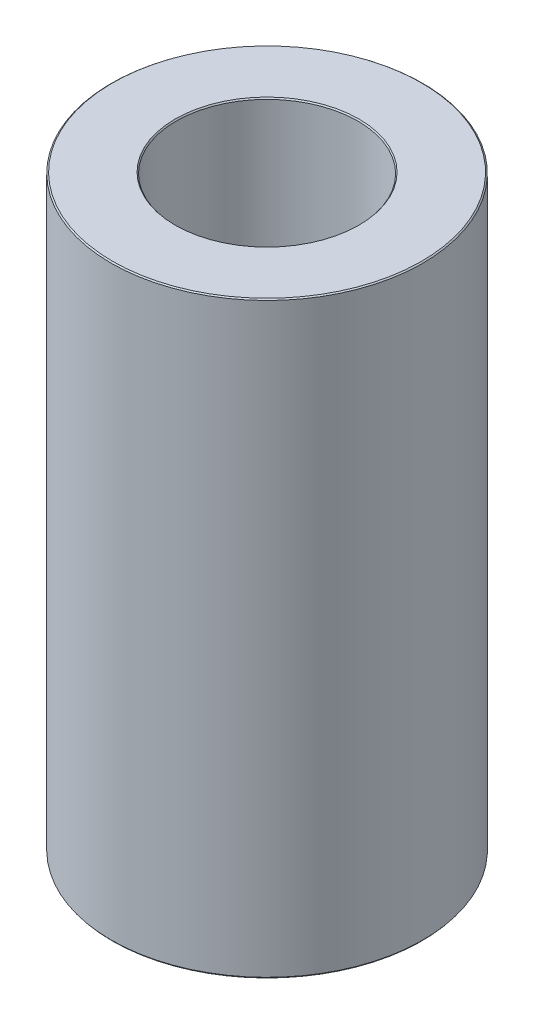
ISO-10303-21;
HEADER;
FILE_DESCRIPTION(('STEP AP214'),'2;1');
FILE_NAME('part.step','',(''),(''),'','','');
FILE_SCHEMA(('AUTOMOTIVE_DESIGN { 1 0 10303 214 1 1 1 1 }'));
ENDSEC;
DATA;
#1=APPLICATION_CONTEXT('core data for automotive mechanical design processes');
#2=APPLICATION_PROTOCOL_DEFINITION('international standard','automotive_design',2000,#1);
#3=PRODUCT_CONTEXT('',#1,'mechanical');
#4=PRODUCT('Part','Part','',(#3));
#5=PRODUCT_RELATED_PRODUCT_CATEGORY('part','',(#4));
#6=PRODUCT_DEFINITION_FORMATION('','',#4);
#7=PRODUCT_DEFINITION_CONTEXT('part definition',#1,'design');
#8=PRODUCT_DEFINITION('design','',#6,#7);
#9=PRODUCT_DEFINITION_SHAPE('','',#8);
#10=(LENGTH_UNIT() NAMED_UNIT(*) SI_UNIT(.MILLI.,.METRE.));
#11=(NAMED_UNIT(*) PLANE_ANGLE_UNIT() SI_UNIT($,.RADIAN.));
#12=(NAMED_UNIT(*) SI_UNIT($,.STERADIAN.) SOLID_ANGLE_UNIT());
#13=UNCERTAINTY_MEASURE_WITH_UNIT(LENGTH_MEASURE(1.E-05),#10,'distance_accuracy_value','');
#14=(GEOMETRIC_REPRESENTATION_CONTEXT(3) GLOBAL_UNCERTAINTY_ASSIGNED_CONTEXT((#13)) GLOBAL_UNIT_ASSIGNED_CONTEXT((#10,
#11,#12)) REPRESENTATION_CONTEXT('',''));
#15=CARTESIAN_POINT('',(0.,0.,0.));
#16=DIRECTION('',(0.,0.,1.));
#17=DIRECTION('',(1.,0.,0.));
#18=AXIS2_PLACEMENT_3D('',#15,#16,#17);
#19=CARTESIAN_POINT('',(0.,188.865511069776,0.));
#20=DIRECTION('',(0.,-1.,0.));
#21=DIRECTION('',(0.,0.,-1.));
#22=AXIS2_PLACEMENT_3D('',#19,#20,#21);
#23=CYLINDRICAL_SURFACE('',#22,50.);
#24=CARTESIAN_POINT('',(0.,0.412753053179421,0.));
#25=DIRECTION('',(0.,1.,0.));
#26=DIRECTION('',(0.,0.,1.));
#27=AXIS2_PLACEMENT_3D('',#24,#25,#26);
#28=CIRCLE('',#27,50.);
#29=CARTESIAN_POINT('',(0.,0.412753053179421,50.));
#30=VERTEX_POINT('',#29);
#31=EDGE_CURVE('E10',#30,#30,#28,.T.);
#32=ORIENTED_EDGE('',*,*,#31,.T.);
#33=EDGE_LOOP('',(#32));
#34=FACE_BOUND('',#33,.T.);
#35=CARTESIAN_POINT('',(0.,188.536881884331,0.));
#36=DIRECTION('',(0.,1.,0.));
#37=DIRECTION('',(0.,0.,1.));
#38=AXIS2_PLACEMENT_3D('',#35,#36,#37);
#39=CIRCLE('',#38,50.);
#40=CARTESIAN_POINT('',(0.,188.536881884331,50.));
#41=VERTEX_POINT('',#40);
#42=EDGE_CURVE('E50',#41,#41,#39,.F.);
#43=ORIENTED_EDGE('',*,*,#42,.T.);
#44=EDGE_LOOP('',(#43));
#45=FACE_BOUND('',#44,.T.);
#46=ADVANCED_FACE('F39',(#34,#45),#23,.T.);
#47=CARTESIAN_POINT('',(0.,188.865511069776,0.));
#48=DIRECTION('',(0.,1.,0.));
#49=DIRECTION('',(0.,0.,1.));
#50=AXIS2_PLACEMENT_3D('',#47,#48,#49);
#51=PLANE('',#50);
#52=CARTESIAN_POINT('',(0.,188.865511069776,0.));
#53=DIRECTION('',(0.,1.,0.));
#54=DIRECTION('',(0.,0.,1.));
#55=AXIS2_PLACEMENT_3D('',#52,#53,#54);
#56=CIRCLE('',#55,29.5054573297817);
#57=CARTESIAN_POINT('',(0.,188.865511069776,29.5054573297817));
#58=VERTEX_POINT('',#57);
#59=EDGE_CURVE('E58',#58,#58,#56,.F.);
#60=ORIENTED_EDGE('',*,*,#59,.T.);
#61=EDGE_LOOP('',(#60));
#62=FACE_BOUND('',#61,.T.);
#63=CARTESIAN_POINT('',(0.,188.865511069776,0.));
#64=DIRECTION('',(0.,1.,0.));
#65=DIRECTION('',(0.,0.,1.));
#66=AXIS2_PLACEMENT_3D('',#63,#64,#65);
#67=CIRCLE('',#66,49.5872469468206);
#68=CARTESIAN_POINT('',(0.,188.865511069776,49.5872469468206));
#69=VERTEX_POINT('',#68);
#70=EDGE_CURVE('E61',#69,#69,#67,.T.);
#71=ORIENTED_EDGE('',*,*,#70,.T.);
#72=EDGE_LOOP('',(#71));
#73=FACE_BOUND('',#72,.T.);
#74=ADVANCED_FACE('F88',(#62,#73),#51,.T.);
#75=CARTESIAN_POINT('',(0.,0.,0.));
#76=DIRECTION('',(0.,1.,0.));
#77=DIRECTION('',(0.,0.,1.));
#78=AXIS2_PLACEMENT_3D('',#75,#76,#77);
#79=PLANE('',#78);
#80=CARTESIAN_POINT('',(0.,0.,0.));
#81=DIRECTION('',(0.,1.,0.));
#82=DIRECTION('',(0.,0.,1.));
#83=AXIS2_PLACEMENT_3D('',#80,#81,#82);
#84=CIRCLE('',#83,29.5895811975155);
#85=CARTESIAN_POINT('',(0.,0.,29.5895811975155));
#86=VERTEX_POINT('',#85);
#87=EDGE_CURVE('E51',#86,#86,#84,.T.);
#88=ORIENTED_EDGE('',*,*,#87,.T.);
#89=EDGE_LOOP('',(#88));
#90=FACE_BOUND('',#89,.T.);
#91=CARTESIAN_POINT('',(0.,0.,0.));
#92=DIRECTION('',(0.,1.,0.));
#93=DIRECTION('',(0.,0.,1.));
#94=AXIS2_PLACEMENT_3D('',#91,#92,#93);
#95=CIRCLE('',#94,49.6713708145543);
#96=CARTESIAN_POINT('',(0.,0.,49.6713708145543));
#97=VERTEX_POINT('',#96);
#98=EDGE_CURVE('E54',#97,#97,#95,.F.);
#99=ORIENTED_EDGE('',*,*,#98,.T.);
#100=EDGE_LOOP('',(#99));
#101=FACE_BOUND('',#100,.T.);
#102=ADVANCED_FACE('F83',(#90,#101),#79,.F.);
#103=CARTESIAN_POINT('',(0.,188.865511069776,0.));
#104=DIRECTION('',(0.,-1.,0.));
#105=DIRECTION('',(0.,0.,-1.));
#106=AXIS2_PLACEMENT_3D('',#103,#104,#105);
#107=CYLINDRICAL_SURFACE('',#106,29.1768281443361);
#108=CARTESIAN_POINT('',(0.,188.452758016597,0.));
#109=DIRECTION('',(0.,1.,0.));
#110=DIRECTION('',(0.,0.,1.));
#111=AXIS2_PLACEMENT_3D('',#108,#109,#110);
#112=CIRCLE('',#111,29.1768281443361);
#113=CARTESIAN_POINT('',(0.,188.452758016597,29.1768281443361));
#114=VERTEX_POINT('',#113);
#115=EDGE_CURVE('E67',#114,#114,#112,.T.);
#116=ORIENTED_EDGE('',*,*,#115,.T.);
#117=EDGE_LOOP('',(#116));
#118=FACE_BOUND('',#117,.T.);
#119=CARTESIAN_POINT('',(0.,0.328629185445711,0.));
#120=DIRECTION('',(0.,1.,0.));
#121=DIRECTION('',(0.,0.,1.));
#122=AXIS2_PLACEMENT_3D('',#119,#120,#121);
#123=CIRCLE('',#122,29.1768281443361);
#124=CARTESIAN_POINT('',(0.,0.328629185445711,29.1768281443361));
#125=VERTEX_POINT('',#124);
#126=EDGE_CURVE('E69',#125,#125,#123,.F.);
#127=ORIENTED_EDGE('',*,*,#126,.T.);
#128=EDGE_LOOP('',(#127));
#129=FACE_BOUND('',#128,.T.);
#130=ADVANCED_FACE('F71',(#118,#129),#107,.F.);
#131=CARTESIAN_POINT('',(0.,188.452758016597,0.));
#132=DIRECTION('',(0.,1.,0.));
#133=DIRECTION('',(0.,0.,1.));
#134=AXIS2_PLACEMENT_3D('',#131,#132,#133);
#135=CONICAL_SURFACE('',#134,29.1768281443361,0.67241245950527);
#136=ORIENTED_EDGE('',*,*,#59,.F.);
#137=EDGE_LOOP('',(#136));
#138=FACE_BOUND('',#137,.T.);
#139=ORIENTED_EDGE('',*,*,#115,.F.);
#140=EDGE_LOOP('',(#139));
#141=FACE_BOUND('',#140,.T.);
#142=ADVANCED_FACE('F77',(#138,#141),#135,.F.);
#143=CARTESIAN_POINT('',(0.,0.,0.));
#144=DIRECTION('',(0.,-1.,0.));
#145=DIRECTION('',(0.,0.,-1.));
#146=AXIS2_PLACEMENT_3D('',#143,#144,#145);
#147=CONICAL_SURFACE('',#146,29.5895811975155,0.898383867289635);
#148=ORIENTED_EDGE('',*,*,#126,.F.);
#149=EDGE_LOOP('',(#148));
#150=FACE_BOUND('',#149,.T.);
#151=ORIENTED_EDGE('',*,*,#87,.F.);
#152=EDGE_LOOP('',(#151));
#153=FACE_BOUND('',#152,.T.);
#154=ADVANCED_FACE('F73',(#150,#153),#147,.F.);
#155=CARTESIAN_POINT('',(0.,0.412753053179421,0.));
#156=DIRECTION('',(0.,1.,0.));
#157=DIRECTION('',(0.,0.,1.));
#158=AXIS2_PLACEMENT_3D('',#155,#156,#157);
#159=CONICAL_SURFACE('',#158,50.,0.672412459505233);
#160=ORIENTED_EDGE('',*,*,#98,.F.);
#161=EDGE_LOOP('',(#160));
#162=FACE_BOUND('',#161,.T.);
#163=ORIENTED_EDGE('',*,*,#31,.F.);
#164=EDGE_LOOP('',(#163));
#165=FACE_BOUND('',#164,.T.);
#166=ADVANCED_FACE('F76',(#162,#165),#159,.T.);
#167=CARTESIAN_POINT('',(0.,188.865511069776,0.));
#168=DIRECTION('',(0.,-1.,0.));
#169=DIRECTION('',(0.,0.,-1.));
#170=AXIS2_PLACEMENT_3D('',#167,#168,#169);
#171=CONICAL_SURFACE('',#170,49.5872469468206,0.898383867289603);
#172=ORIENTED_EDGE('',*,*,#42,.F.);
#173=EDGE_LOOP('',(#172));
#174=FACE_BOUND('',#173,.T.);
#175=ORIENTED_EDGE('',*,*,#70,.F.);
#176=EDGE_LOOP('',(#175));
#177=FACE_BOUND('',#176,.T.);
#178=ADVANCED_FACE('F45',(#174,#177),#171,.T.);
#179=CLOSED_SHELL('',(#46,#74,#102,#130,#142,#154,#166,#178));
#180=MANIFOLD_SOLID_BREP('B2',#179);
#181=ADVANCED_BREP_SHAPE_REPRESENTATION('',(#18,#180),#14);
#182=SHAPE_DEFINITION_REPRESENTATION(#9,#181);
ENDSEC;
END-ISO-10303-21;
